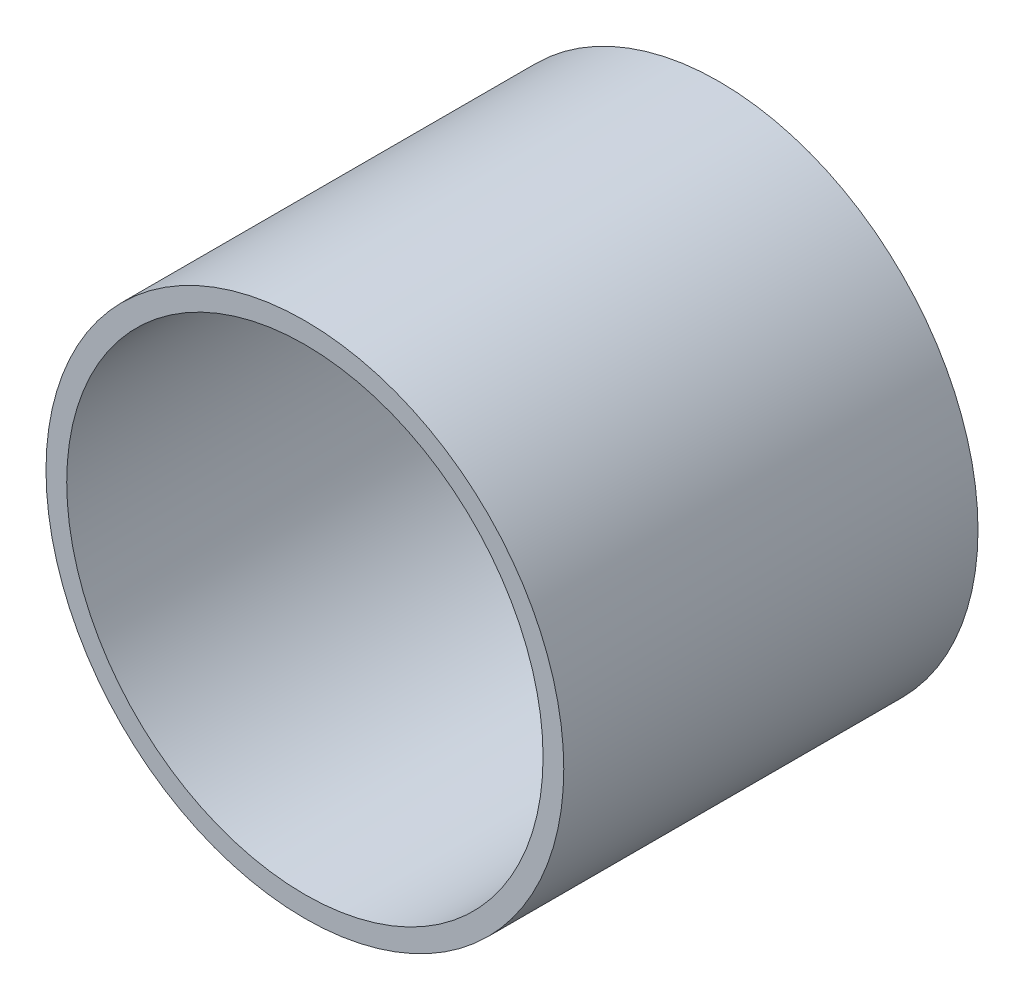
ISO-10303-21;
HEADER;
FILE_DESCRIPTION(('STEP AP214'),'2;1');
FILE_NAME('part.step','',(''),(''),'','','');
FILE_SCHEMA(('AUTOMOTIVE_DESIGN { 1 0 10303 214 1 1 1 1 }'));
ENDSEC;
DATA;
#1=APPLICATION_CONTEXT('core data for automotive mechanical design processes');
#2=APPLICATION_PROTOCOL_DEFINITION('international standard','automotive_design',2000,#1);
#3=PRODUCT_CONTEXT('',#1,'mechanical');
#4=PRODUCT('Part','Part','',(#3));
#5=PRODUCT_RELATED_PRODUCT_CATEGORY('part','',(#4));
#6=PRODUCT_DEFINITION_FORMATION('','',#4);
#7=PRODUCT_DEFINITION_CONTEXT('part definition',#1,'design');
#8=PRODUCT_DEFINITION('design','',#6,#7);
#9=PRODUCT_DEFINITION_SHAPE('','',#8);
#10=(LENGTH_UNIT() NAMED_UNIT(*) SI_UNIT(.MILLI.,.METRE.));
#11=(NAMED_UNIT(*) PLANE_ANGLE_UNIT() SI_UNIT($,.RADIAN.));
#12=(NAMED_UNIT(*) SI_UNIT($,.STERADIAN.) SOLID_ANGLE_UNIT());
#13=UNCERTAINTY_MEASURE_WITH_UNIT(LENGTH_MEASURE(1.E-05),#10,'distance_accuracy_value','');
#14=(GEOMETRIC_REPRESENTATION_CONTEXT(3) GLOBAL_UNCERTAINTY_ASSIGNED_CONTEXT((#13)) GLOBAL_UNIT_ASSIGNED_CONTEXT((#10,
#11,#12)) REPRESENTATION_CONTEXT('',''));
#15=CARTESIAN_POINT('',(0.,0.,0.));
#16=DIRECTION('',(0.,0.,1.));
#17=DIRECTION('',(1.,0.,0.));
#18=AXIS2_PLACEMENT_3D('',#15,#16,#17);
#19=CARTESIAN_POINT('',(0.,0.,127.));
#20=DIRECTION('',(0.,0.,1.));
#21=DIRECTION('',(1.,0.,0.));
#22=AXIS2_PLACEMENT_3D('',#19,#20,#21);
#23=PLANE('',#22);
#24=CARTESIAN_POINT('',(0.,0.,127.));
#25=DIRECTION('',(0.,0.,1.));
#26=DIRECTION('',(1.,0.,0.));
#27=AXIS2_PLACEMENT_3D('',#24,#25,#26);
#28=CIRCLE('',#27,79.375);
#29=CARTESIAN_POINT('',(79.375,0.,127.));
#30=VERTEX_POINT('',#29);
#31=EDGE_CURVE('E10',#30,#30,#28,.T.);
#32=ORIENTED_EDGE('',*,*,#31,.T.);
#33=EDGE_LOOP('',(#32));
#34=FACE_BOUND('',#33,.T.);
#35=CARTESIAN_POINT('',(0.,0.,127.));
#36=DIRECTION('',(0.,0.,1.));
#37=DIRECTION('',(1.,0.,0.));
#38=AXIS2_PLACEMENT_3D('',#35,#36,#37);
#39=CIRCLE('',#38,73.025);
#40=CARTESIAN_POINT('',(73.025,0.,127.));
#41=VERTEX_POINT('',#40);
#42=EDGE_CURVE('E50',#41,#41,#39,.T.);
#43=ORIENTED_EDGE('',*,*,#42,.F.);
#44=EDGE_LOOP('',(#43));
#45=FACE_BOUND('',#44,.T.);
#46=ADVANCED_FACE('F37',(#34,#45),#23,.T.);
#47=CARTESIAN_POINT('',(0.,0.,0.));
#48=DIRECTION('',(0.,0.,1.));
#49=DIRECTION('',(1.,0.,0.));
#50=AXIS2_PLACEMENT_3D('',#47,#48,#49);
#51=PLANE('',#50);
#52=CARTESIAN_POINT('',(0.,0.,0.));
#53=DIRECTION('',(0.,0.,1.));
#54=DIRECTION('',(1.,0.,0.));
#55=AXIS2_PLACEMENT_3D('',#52,#53,#54);
#56=CIRCLE('',#55,79.375);
#57=CARTESIAN_POINT('',(79.375,0.,0.));
#58=VERTEX_POINT('',#57);
#59=EDGE_CURVE('E41',#58,#58,#56,.T.);
#60=ORIENTED_EDGE('',*,*,#59,.F.);
#61=EDGE_LOOP('',(#60));
#62=FACE_BOUND('',#61,.T.);
#63=CARTESIAN_POINT('',(0.,0.,0.));
#64=DIRECTION('',(0.,0.,1.));
#65=DIRECTION('',(1.,0.,0.));
#66=AXIS2_PLACEMENT_3D('',#63,#64,#65);
#67=CIRCLE('',#66,73.025);
#68=CARTESIAN_POINT('',(73.025,0.,0.));
#69=VERTEX_POINT('',#68);
#70=EDGE_CURVE('E52',#69,#69,#67,.T.);
#71=ORIENTED_EDGE('',*,*,#70,.T.);
#72=EDGE_LOOP('',(#71));
#73=FACE_BOUND('',#72,.T.);
#74=ADVANCED_FACE('F64',(#62,#73),#51,.F.);
#75=CARTESIAN_POINT('',(0.,0.,127.));
#76=DIRECTION('',(0.,0.,-1.));
#77=DIRECTION('',(-1.,0.,0.));
#78=AXIS2_PLACEMENT_3D('',#75,#76,#77);
#79=CYLINDRICAL_SURFACE('',#78,79.375);
#80=ORIENTED_EDGE('',*,*,#31,.F.);
#81=EDGE_LOOP('',(#80));
#82=FACE_BOUND('',#81,.T.);
#83=ORIENTED_EDGE('',*,*,#59,.T.);
#84=EDGE_LOOP('',(#83));
#85=FACE_BOUND('',#84,.T.);
#86=ADVANCED_FACE('F39',(#82,#85),#79,.T.);
#87=CARTESIAN_POINT('',(0.,0.,127.));
#88=DIRECTION('',(0.,0.,-1.));
#89=DIRECTION('',(-1.,0.,0.));
#90=AXIS2_PLACEMENT_3D('',#87,#88,#89);
#91=CYLINDRICAL_SURFACE('',#90,73.025);
#92=ORIENTED_EDGE('',*,*,#42,.T.);
#93=EDGE_LOOP('',(#92));
#94=FACE_BOUND('',#93,.T.);
#95=ORIENTED_EDGE('',*,*,#70,.F.);
#96=EDGE_LOOP('',(#95));
#97=FACE_BOUND('',#96,.T.);
#98=ADVANCED_FACE('F60',(#94,#97),#91,.F.);
#99=CLOSED_SHELL('',(#46,#74,#86,#98));
#100=MANIFOLD_SOLID_BREP('B2',#99);
#101=ADVANCED_BREP_SHAPE_REPRESENTATION('',(#18,#100),#14);
#102=SHAPE_DEFINITION_REPRESENTATION(#9,#101);
ENDSEC;
END-ISO-10303-21;
